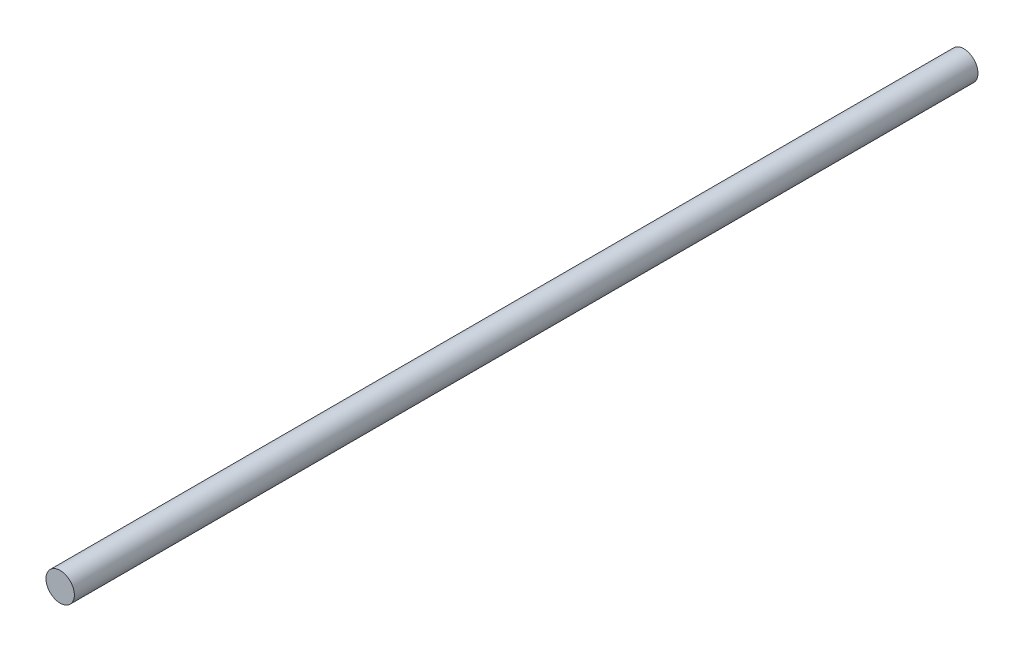
ISO-10303-21;
HEADER;
FILE_DESCRIPTION(('STEP AP214'),'2;1');
FILE_NAME('part.step','',(''),(''),'','','');
FILE_SCHEMA(('AUTOMOTIVE_DESIGN { 1 0 10303 214 1 1 1 1 }'));
ENDSEC;
DATA;
#1=APPLICATION_CONTEXT('core data for automotive mechanical design processes');
#2=APPLICATION_PROTOCOL_DEFINITION('international standard','automotive_design',2000,#1);
#3=PRODUCT_CONTEXT('',#1,'mechanical');
#4=PRODUCT('Part','Part','',(#3));
#5=PRODUCT_RELATED_PRODUCT_CATEGORY('part','',(#4));
#6=PRODUCT_DEFINITION_FORMATION('','',#4);
#7=PRODUCT_DEFINITION_CONTEXT('part definition',#1,'design');
#8=PRODUCT_DEFINITION('design','',#6,#7);
#9=PRODUCT_DEFINITION_SHAPE('','',#8);
#10=(LENGTH_UNIT() NAMED_UNIT(*) SI_UNIT(.MILLI.,.METRE.));
#11=(NAMED_UNIT(*) PLANE_ANGLE_UNIT() SI_UNIT($,.RADIAN.));
#12=(NAMED_UNIT(*) SI_UNIT($,.STERADIAN.) SOLID_ANGLE_UNIT());
#13=UNCERTAINTY_MEASURE_WITH_UNIT(LENGTH_MEASURE(1.E-05),#10,'distance_accuracy_value','');
#14=(GEOMETRIC_REPRESENTATION_CONTEXT(3) GLOBAL_UNCERTAINTY_ASSIGNED_CONTEXT((#13)) GLOBAL_UNIT_ASSIGNED_CONTEXT((#10,
#11,#12)) REPRESENTATION_CONTEXT('',''));
#15=CARTESIAN_POINT('',(0.,0.,0.));
#16=DIRECTION('',(0.,0.,1.));
#17=DIRECTION('',(1.,0.,0.));
#18=AXIS2_PLACEMENT_3D('',#15,#16,#17);
#19=CARTESIAN_POINT('',(0.,0.,191.));
#20=DIRECTION('',(0.,0.,-1.));
#21=DIRECTION('',(-1.,0.,0.));
#22=AXIS2_PLACEMENT_3D('',#19,#20,#21);
#23=CYLINDRICAL_SURFACE('',#22,3.);
#24=CARTESIAN_POINT('',(0.,0.,191.));
#25=DIRECTION('',(0.,0.,1.));
#26=DIRECTION('',(1.,0.,0.));
#27=AXIS2_PLACEMENT_3D('',#24,#25,#26);
#28=CIRCLE('',#27,3.);
#29=CARTESIAN_POINT('',(3.,0.,191.));
#30=VERTEX_POINT('',#29);
#31=EDGE_CURVE('E10',#30,#30,#28,.T.);
#32=ORIENTED_EDGE('',*,*,#31,.F.);
#33=EDGE_LOOP('',(#32));
#34=FACE_BOUND('',#33,.T.);
#35=CARTESIAN_POINT('',(0.,0.,0.));
#36=DIRECTION('',(0.,0.,1.));
#37=DIRECTION('',(1.,0.,0.));
#38=AXIS2_PLACEMENT_3D('',#35,#36,#37);
#39=CIRCLE('',#38,3.);
#40=CARTESIAN_POINT('',(3.,0.,0.));
#41=VERTEX_POINT('',#40);
#42=EDGE_CURVE('E33',#41,#41,#39,.T.);
#43=ORIENTED_EDGE('',*,*,#42,.T.);
#44=EDGE_LOOP('',(#43));
#45=FACE_BOUND('',#44,.T.);
#46=ADVANCED_FACE('F30',(#34,#45),#23,.T.);
#47=CARTESIAN_POINT('',(0.,0.,191.));
#48=DIRECTION('',(0.,0.,1.));
#49=DIRECTION('',(1.,0.,0.));
#50=AXIS2_PLACEMENT_3D('',#47,#48,#49);
#51=PLANE('',#50);
#52=ORIENTED_EDGE('',*,*,#31,.T.);
#53=EDGE_LOOP('',(#52));
#54=FACE_BOUND('',#53,.T.);
#55=ADVANCED_FACE('F45',(#54),#51,.T.);
#56=CARTESIAN_POINT('',(0.,0.,0.));
#57=DIRECTION('',(0.,0.,1.));
#58=DIRECTION('',(1.,0.,0.));
#59=AXIS2_PLACEMENT_3D('',#56,#57,#58);
#60=PLANE('',#59);
#61=ORIENTED_EDGE('',*,*,#42,.F.);
#62=EDGE_LOOP('',(#61));
#63=FACE_BOUND('',#62,.T.);
#64=ADVANCED_FACE('F43',(#63),#60,.F.);
#65=CLOSED_SHELL('',(#46,#55,#64));
#66=MANIFOLD_SOLID_BREP('B2',#65);
#67=ADVANCED_BREP_SHAPE_REPRESENTATION('',(#18,#66),#14);
#68=SHAPE_DEFINITION_REPRESENTATION(#9,#67);
ENDSEC;
END-ISO-10303-21;
